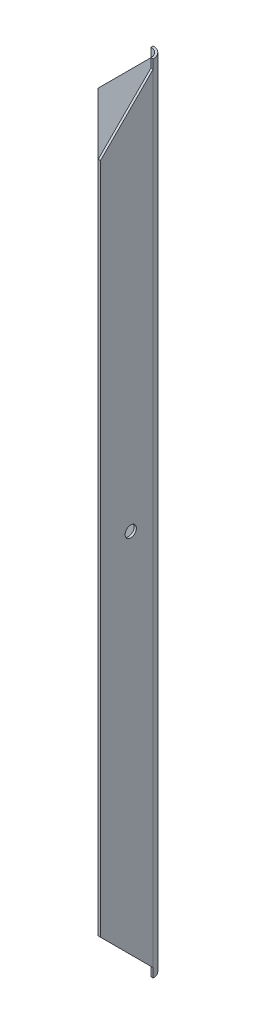
ISO-10303-21;
HEADER;
FILE_DESCRIPTION(('STEP AP214'),'2;1');
FILE_NAME('part.step','',(''),(''),'','','');
FILE_SCHEMA(('AUTOMOTIVE_DESIGN { 1 0 10303 214 1 1 1 1 }'));
ENDSEC;
DATA;
#1=APPLICATION_CONTEXT('core data for automotive mechanical design processes');
#2=APPLICATION_PROTOCOL_DEFINITION('international standard','automotive_design',2000,#1);
#3=PRODUCT_CONTEXT('',#1,'mechanical');
#4=PRODUCT('Part','Part','',(#3));
#5=PRODUCT_RELATED_PRODUCT_CATEGORY('part','',(#4));
#6=PRODUCT_DEFINITION_FORMATION('','',#4);
#7=PRODUCT_DEFINITION_CONTEXT('part definition',#1,'design');
#8=PRODUCT_DEFINITION('design','',#6,#7);
#9=PRODUCT_DEFINITION_SHAPE('','',#8);
#10=(LENGTH_UNIT() NAMED_UNIT(*) SI_UNIT(.MILLI.,.METRE.));
#11=(NAMED_UNIT(*) PLANE_ANGLE_UNIT() SI_UNIT($,.RADIAN.));
#12=(NAMED_UNIT(*) SI_UNIT($,.STERADIAN.) SOLID_ANGLE_UNIT());
#13=UNCERTAINTY_MEASURE_WITH_UNIT(LENGTH_MEASURE(1.E-05),#10,'distance_accuracy_value','');
#14=(GEOMETRIC_REPRESENTATION_CONTEXT(3) GLOBAL_UNCERTAINTY_ASSIGNED_CONTEXT((#13)) GLOBAL_UNIT_ASSIGNED_CONTEXT((#10,
#11,#12)) REPRESENTATION_CONTEXT('',''));
#15=CARTESIAN_POINT('',(0.,0.,0.));
#16=DIRECTION('',(0.,0.,1.));
#17=DIRECTION('',(1.,0.,0.));
#18=AXIS2_PLACEMENT_3D('',#15,#16,#17);
#19=CARTESIAN_POINT('',(0.,355.,-47.));
#20=DIRECTION('',(0.,0.,-1.));
#21=DIRECTION('',(-1.,0.,0.));
#22=AXIS2_PLACEMENT_3D('',#19,#20,#21);
#23=PLANE('',#22);
#24=DIRECTION('',(1.,0.,0.));
#25=VECTOR('',#24,1.);
#26=CARTESIAN_POINT('',(0.,-347.,-47.));
#27=LINE('',#26,#25);
#28=CARTESIAN_POINT('',(0.,-347.,-47.));
#29=VERTEX_POINT('',#28);
#30=CARTESIAN_POINT('',(1.99999999999999,-347.,-47.));
#31=VERTEX_POINT('',#30);
#32=EDGE_CURVE('E11',#29,#31,#27,.T.);
#33=ORIENTED_EDGE('',*,*,#32,.F.);
#34=DIRECTION('',(0.,-1.,0.));
#35=VECTOR('',#34,1.);
#36=CARTESIAN_POINT('',(0.,355.,-47.));
#37=LINE('',#36,#35);
#38=CARTESIAN_POINT('',(0.,-355.,-47.));
#39=VERTEX_POINT('',#38);
#40=EDGE_CURVE('E151',#29,#39,#37,.T.);
#41=ORIENTED_EDGE('',*,*,#40,.T.);
#42=DIRECTION('',(1.,0.,0.));
#43=VECTOR('',#42,1.);
#44=CARTESIAN_POINT('',(0.,-355.,-47.));
#45=LINE('',#44,#43);
#46=CARTESIAN_POINT('',(1.99999999999999,-355.,-47.));
#47=VERTEX_POINT('',#46);
#48=EDGE_CURVE('E205',#39,#47,#45,.T.);
#49=ORIENTED_EDGE('',*,*,#48,.T.);
#50=DIRECTION('',(0.,-1.,0.));
#51=VECTOR('',#50,1.);
#52=CARTESIAN_POINT('',(1.99999999999999,355.,-47.));
#53=LINE('',#52,#51);
#54=EDGE_CURVE('E168',#31,#47,#53,.T.);
#55=ORIENTED_EDGE('',*,*,#54,.F.);
#56=EDGE_LOOP('',(#33,#41,#49,#55));
#57=FACE_BOUND('',#56,.T.);
#58=ADVANCED_FACE('F41',(#57),#23,.F.);
#59=DIRECTION('',(-1.,0.,0.));
#60=VECTOR('',#59,1.);
#61=CARTESIAN_POINT('',(0.,347.,-47.));
#62=LINE('',#61,#60);
#63=CARTESIAN_POINT('',(2.,347.,-47.));
#64=VERTEX_POINT('',#63);
#65=CARTESIAN_POINT('',(0.,347.,-47.0000000000001));
#66=VERTEX_POINT('',#65);
#67=EDGE_CURVE('E49',#64,#66,#62,.T.);
#68=ORIENTED_EDGE('',*,*,#67,.F.);
#69=CARTESIAN_POINT('',(1.99999999999999,355.,-47.));
#70=VERTEX_POINT('',#69);
#71=EDGE_CURVE('E162',#70,#64,#53,.T.);
#72=ORIENTED_EDGE('',*,*,#71,.F.);
#73=DIRECTION('',(1.,0.,0.));
#74=VECTOR('',#73,1.);
#75=CARTESIAN_POINT('',(0.,355.,-47.));
#76=LINE('',#75,#74);
#77=CARTESIAN_POINT('',(0.,355.,-47.));
#78=VERTEX_POINT('',#77);
#79=EDGE_CURVE('E155',#78,#70,#76,.T.);
#80=ORIENTED_EDGE('',*,*,#79,.F.);
#81=EDGE_CURVE('E147',#78,#66,#37,.T.);
#82=ORIENTED_EDGE('',*,*,#81,.T.);
#83=EDGE_LOOP('',(#68,#72,#80,#82));
#84=FACE_BOUND('',#83,.T.);
#85=ADVANCED_FACE('F153',(#84),#23,.F.);
#86=CARTESIAN_POINT('',(-54.9999999999999,300.,-54.9999999999999));
#87=DIRECTION('',(-1.,0.,0.));
#88=DIRECTION('',(0.,-1.,0.));
#89=AXIS2_PLACEMENT_3D('',#86,#87,#88);
#90=PLANE('',#89);
#91=DIRECTION('',(0.,1.,0.));
#92=VECTOR('',#91,1.);
#93=CARTESIAN_POINT('',(-54.9999999999999,300.,-56.9999999999999));
#94=LINE('',#93,#92);
#95=CARTESIAN_POINT('',(-55.,-300.,-57.));
#96=VERTEX_POINT('',#95);
#97=CARTESIAN_POINT('',(-54.9999999999999,300.,-56.9999999999999));
#98=VERTEX_POINT('',#97);
#99=EDGE_CURVE('E80',#96,#98,#94,.T.);
#100=ORIENTED_EDGE('',*,*,#99,.F.);
#101=DIRECTION('',(0.,0.,-1.));
#102=VECTOR('',#101,1.);
#103=CARTESIAN_POINT('',(-55.,-300.,-55.));
#104=LINE('',#103,#102);
#105=CARTESIAN_POINT('',(-55.,-300.,-55.));
#106=VERTEX_POINT('',#105);
#107=EDGE_CURVE('E83',#106,#96,#104,.T.);
#108=ORIENTED_EDGE('',*,*,#107,.F.);
#109=DIRECTION('',(0.,1.,0.));
#110=VECTOR('',#109,1.);
#111=CARTESIAN_POINT('',(-54.9999999999999,300.,-54.9999999999999));
#112=LINE('',#111,#110);
#113=CARTESIAN_POINT('',(-54.9999999999999,300.,-54.9999999999999));
#114=VERTEX_POINT('',#113);
#115=EDGE_CURVE('E82',#106,#114,#112,.T.);
#116=ORIENTED_EDGE('',*,*,#115,.T.);
#117=DIRECTION('',(0.,0.,-1.));
#118=VECTOR('',#117,1.);
#119=CARTESIAN_POINT('',(-54.9999999999999,300.,-54.9999999999999));
#120=LINE('',#119,#118);
#121=EDGE_CURVE('E64',#114,#98,#120,.T.);
#122=ORIENTED_EDGE('',*,*,#121,.T.);
#123=EDGE_LOOP('',(#100,#108,#116,#122));
#124=FACE_BOUND('',#123,.T.);
#125=ADVANCED_FACE('F77',(#124),#90,.T.);
#126=CARTESIAN_POINT('',(0.,0.,-54.9999999999999));
#127=DIRECTION('',(0.,0.,1.));
#128=DIRECTION('',(0.,-1.,0.));
#129=AXIS2_PLACEMENT_3D('',#126,#127,#128);
#130=PLANE('',#129);
#131=CARTESIAN_POINT('',(-28.,0.,-54.9999999999999));
#132=DIRECTION('',(0.,0.,1.));
#133=DIRECTION('',(0.,-1.,0.));
#134=AXIS2_PLACEMENT_3D('',#131,#132,#133);
#135=CIRCLE('',#134,5.);
#136=CARTESIAN_POINT('',(-28.,-4.99999999999998,-54.9999999999999));
#137=VERTEX_POINT('',#136);
#138=EDGE_CURVE('E226',#137,#137,#135,.T.);
#139=ORIENTED_EDGE('',*,*,#138,.F.);
#140=EDGE_LOOP('',(#139));
#141=FACE_BOUND('',#140,.T.);
#142=DIRECTION('',(0.,-1.,0.));
#143=VECTOR('',#142,1.);
#144=CARTESIAN_POINT('',(-7.99999999999999,355.,-55.));
#145=LINE('',#144,#143);
#146=CARTESIAN_POINT('',(-7.99999999999999,347.,-55.));
#147=VERTEX_POINT('',#146);
#148=CARTESIAN_POINT('',(-7.99999999999999,-347.,-55.));
#149=VERTEX_POINT('',#148);
#150=EDGE_CURVE('E158',#147,#149,#145,.T.);
#151=ORIENTED_EDGE('',*,*,#150,.F.);
#152=DIRECTION('',(0.707106781186549,0.707106781186546,0.));
#153=VECTOR('',#152,1.);
#154=CARTESIAN_POINT('',(-54.9999999999999,300.,-54.9999999999999));
#155=LINE('',#154,#153);
#156=EDGE_CURVE('E105',#114,#147,#155,.T.);
#157=ORIENTED_EDGE('',*,*,#156,.F.);
#158=ORIENTED_EDGE('',*,*,#115,.F.);
#159=DIRECTION('',(-0.70710678118655,0.707106781186545,0.));
#160=VECTOR('',#159,1.);
#161=CARTESIAN_POINT('',(-55.,-300.,-55.));
#162=LINE('',#161,#160);
#163=EDGE_CURVE('E95',#149,#106,#162,.T.);
#164=ORIENTED_EDGE('',*,*,#163,.F.);
#165=EDGE_LOOP('',(#151,#157,#158,#164));
#166=FACE_BOUND('',#165,.T.);
#167=ADVANCED_FACE('F189',(#141,#166),#130,.T.);
#168=CARTESIAN_POINT('',(-54.9999999999999,300.,-54.9999999999999));
#169=DIRECTION('',(-0.707106781186546,0.707106781186549,0.));
#170=DIRECTION('',(-0.707106781186549,-0.707106781186546,0.));
#171=AXIS2_PLACEMENT_3D('',#168,#169,#170);
#172=PLANE('',#171);
#173=DIRECTION('',(0.,0.,1.));
#174=VECTOR('',#173,1.);
#175=CARTESIAN_POINT('',(-7.99999999999999,347.,-54.9999999999998));
#176=LINE('',#175,#174);
#177=CARTESIAN_POINT('',(-7.99999999999999,347.,-57.));
#178=VERTEX_POINT('',#177);
#179=EDGE_CURVE('E91',#178,#147,#176,.T.);
#180=ORIENTED_EDGE('',*,*,#179,.F.);
#181=DIRECTION('',(0.707106781186549,0.707106781186546,0.));
#182=VECTOR('',#181,1.);
#183=CARTESIAN_POINT('',(-54.9999999999999,300.,-56.9999999999999));
#184=LINE('',#183,#182);
#185=EDGE_CURVE('E87',#98,#178,#184,.T.);
#186=ORIENTED_EDGE('',*,*,#185,.F.);
#187=ORIENTED_EDGE('',*,*,#121,.F.);
#188=ORIENTED_EDGE('',*,*,#156,.T.);
#189=EDGE_LOOP('',(#180,#186,#187,#188));
#190=FACE_BOUND('',#189,.T.);
#191=ADVANCED_FACE('F88',(#190),#172,.T.);
#192=CARTESIAN_POINT('',(-55.,-300.,-55.));
#193=DIRECTION('',(-0.707106781186545,-0.70710678118655,0.));
#194=DIRECTION('',(0.70710678118655,-0.707106781186545,0.));
#195=AXIS2_PLACEMENT_3D('',#192,#193,#194);
#196=PLANE('',#195);
#197=DIRECTION('',(0.,0.,-1.));
#198=VECTOR('',#197,1.);
#199=CARTESIAN_POINT('',(-7.99999999999999,-347.,-55.));
#200=LINE('',#199,#198);
#201=CARTESIAN_POINT('',(-7.99999999999999,-347.,-57.));
#202=VERTEX_POINT('',#201);
#203=EDGE_CURVE('E178',#149,#202,#200,.T.);
#204=ORIENTED_EDGE('',*,*,#203,.F.);
#205=ORIENTED_EDGE('',*,*,#163,.T.);
#206=ORIENTED_EDGE('',*,*,#107,.T.);
#207=DIRECTION('',(-0.70710678118655,0.707106781186545,0.));
#208=VECTOR('',#207,1.);
#209=CARTESIAN_POINT('',(-55.,-300.,-57.));
#210=LINE('',#209,#208);
#211=EDGE_CURVE('E98',#202,#96,#210,.T.);
#212=ORIENTED_EDGE('',*,*,#211,.F.);
#213=EDGE_LOOP('',(#204,#205,#206,#212));
#214=FACE_BOUND('',#213,.T.);
#215=ADVANCED_FACE('F279',(#214),#196,.T.);
#216=CARTESIAN_POINT('',(2.,0.,-56.9999999999999));
#217=DIRECTION('',(0.,0.,-1.));
#218=DIRECTION('',(0.,1.,0.));
#219=AXIS2_PLACEMENT_3D('',#216,#217,#218);
#220=PLANE('',#219);
#221=CARTESIAN_POINT('',(-28.,0.,-56.9999999999999));
#222=DIRECTION('',(0.,0.,-1.));
#223=DIRECTION('',(0.,1.,0.));
#224=AXIS2_PLACEMENT_3D('',#221,#222,#223);
#225=CIRCLE('',#224,5.);
#226=CARTESIAN_POINT('',(-28.,5.00000000000002,-56.9999999999999));
#227=VERTEX_POINT('',#226);
#228=EDGE_CURVE('E230',#227,#227,#225,.T.);
#229=ORIENTED_EDGE('',*,*,#228,.F.);
#230=EDGE_LOOP('',(#229));
#231=FACE_BOUND('',#230,.T.);
#232=DIRECTION('',(0.,1.,0.));
#233=VECTOR('',#232,1.);
#234=CARTESIAN_POINT('',(-8.,-355.001,-57.));
#235=LINE('',#234,#233);
#236=EDGE_CURVE('E101',#202,#178,#235,.T.);
#237=ORIENTED_EDGE('',*,*,#236,.F.);
#238=ORIENTED_EDGE('',*,*,#211,.T.);
#239=ORIENTED_EDGE('',*,*,#99,.T.);
#240=ORIENTED_EDGE('',*,*,#185,.T.);
#241=EDGE_LOOP('',(#237,#238,#239,#240));
#242=FACE_BOUND('',#241,.T.);
#243=ADVANCED_FACE('F43',(#231,#242),#220,.T.);
#244=CARTESIAN_POINT('',(-8.,-355.001,-47.));
#245=DIRECTION('',(0.,1.,0.));
#246=DIRECTION('',(0.,0.,1.));
#247=AXIS2_PLACEMENT_3D('',#244,#245,#246);
#248=CYLINDRICAL_SURFACE('',#247,10.);
#249=DIRECTION('',(0.,1.,0.));
#250=VECTOR('',#249,1.);
#251=CARTESIAN_POINT('',(2.,-355.001,-47.));
#252=LINE('',#251,#250);
#253=EDGE_CURVE('E214',#31,#64,#252,.T.);
#254=ORIENTED_EDGE('',*,*,#253,.F.);
#255=ORIENTED_EDGE('',*,*,#54,.T.);
#256=CARTESIAN_POINT('',(-8.,-355.,-47.));
#257=DIRECTION('',(0.,-1.,0.));
#258=DIRECTION('',(0.,0.,-1.));
#259=AXIS2_PLACEMENT_3D('',#256,#257,#258);
#260=CIRCLE('',#259,9.99999999999999);
#261=CARTESIAN_POINT('',(-7.99999999999999,-355.,-57.));
#262=VERTEX_POINT('',#261);
#263=EDGE_CURVE('E207',#262,#47,#260,.T.);
#264=ORIENTED_EDGE('',*,*,#263,.F.);
#265=DIRECTION('',(0.,-1.,0.));
#266=VECTOR('',#265,1.);
#267=CARTESIAN_POINT('',(-7.99999999999999,355.,-57.));
#268=LINE('',#267,#266);
#269=EDGE_CURVE('E177',#202,#262,#268,.T.);
#270=ORIENTED_EDGE('',*,*,#269,.F.);
#271=ORIENTED_EDGE('',*,*,#236,.T.);
#272=CARTESIAN_POINT('',(-7.99999999999999,355.,-57.));
#273=VERTEX_POINT('',#272);
#274=EDGE_CURVE('E173',#273,#178,#268,.T.);
#275=ORIENTED_EDGE('',*,*,#274,.F.);
#276=CARTESIAN_POINT('',(-8.,355.,-47.));
#277=DIRECTION('',(0.,-1.,0.));
#278=DIRECTION('',(0.,0.,-1.));
#279=AXIS2_PLACEMENT_3D('',#276,#277,#278);
#280=CIRCLE('',#279,9.99999999999999);
#281=EDGE_CURVE('E198',#273,#70,#280,.T.);
#282=ORIENTED_EDGE('',*,*,#281,.T.);
#283=ORIENTED_EDGE('',*,*,#71,.T.);
#284=EDGE_LOOP('',(#254,#255,#264,#270,#271,#275,#282,#283));
#285=FACE_BOUND('',#284,.T.);
#286=ADVANCED_FACE('F271',(#285),#248,.T.);
#287=CARTESIAN_POINT('',(-7.99999999999999,355.,-55.));
#288=DIRECTION('',(-1.,0.,0.));
#289=DIRECTION('',(0.,0.,1.));
#290=AXIS2_PLACEMENT_3D('',#287,#288,#289);
#291=PLANE('',#290);
#292=ORIENTED_EDGE('',*,*,#274,.T.);
#293=ORIENTED_EDGE('',*,*,#179,.T.);
#294=CARTESIAN_POINT('',(-7.99999999999999,355.,-55.));
#295=VERTEX_POINT('',#294);
#296=EDGE_CURVE('E160',#295,#147,#145,.T.);
#297=ORIENTED_EDGE('',*,*,#296,.F.);
#298=DIRECTION('',(0.,0.,-1.));
#299=VECTOR('',#298,1.);
#300=CARTESIAN_POINT('',(-7.99999999999999,355.,-55.));
#301=LINE('',#300,#299);
#302=EDGE_CURVE('E200',#295,#273,#301,.T.);
#303=ORIENTED_EDGE('',*,*,#302,.T.);
#304=EDGE_LOOP('',(#292,#293,#297,#303));
#305=FACE_BOUND('',#304,.T.);
#306=ADVANCED_FACE('F269',(#305),#291,.T.);
#307=CARTESIAN_POINT('',(-7.99999999999999,-355.,-55.));
#308=VERTEX_POINT('',#307);
#309=EDGE_CURVE('E156',#149,#308,#145,.T.);
#310=ORIENTED_EDGE('',*,*,#309,.F.);
#311=ORIENTED_EDGE('',*,*,#203,.T.);
#312=ORIENTED_EDGE('',*,*,#269,.T.);
#313=DIRECTION('',(0.,0.,-1.));
#314=VECTOR('',#313,1.);
#315=CARTESIAN_POINT('',(-7.99999999999999,-355.,-55.));
#316=LINE('',#315,#314);
#317=EDGE_CURVE('E210',#308,#262,#316,.T.);
#318=ORIENTED_EDGE('',*,*,#317,.F.);
#319=EDGE_LOOP('',(#310,#311,#312,#318));
#320=FACE_BOUND('',#319,.T.);
#321=ADVANCED_FACE('F266',(#320),#291,.T.);
#322=CARTESIAN_POINT('',(-8.,355.,-47.));
#323=DIRECTION('',(0.,-1.,0.));
#324=DIRECTION('',(0.,0.,-1.));
#325=AXIS2_PLACEMENT_3D('',#322,#323,#324);
#326=CYLINDRICAL_SURFACE('',#325,8.);
#327=ORIENTED_EDGE('',*,*,#296,.T.);
#328=ORIENTED_EDGE('',*,*,#150,.T.);
#329=ORIENTED_EDGE('',*,*,#309,.T.);
#330=CARTESIAN_POINT('',(-8.,-355.,-47.));
#331=DIRECTION('',(0.,-1.,0.));
#332=DIRECTION('',(0.,0.,-1.));
#333=AXIS2_PLACEMENT_3D('',#330,#331,#332);
#334=CIRCLE('',#333,8.);
#335=EDGE_CURVE('E203',#308,#39,#334,.T.);
#336=ORIENTED_EDGE('',*,*,#335,.T.);
#337=ORIENTED_EDGE('',*,*,#40,.F.);
#338=EDGE_CURVE('E134',#66,#29,#37,.T.);
#339=ORIENTED_EDGE('',*,*,#338,.F.);
#340=ORIENTED_EDGE('',*,*,#81,.F.);
#341=CARTESIAN_POINT('',(-8.,355.,-47.));
#342=DIRECTION('',(0.,-1.,0.));
#343=DIRECTION('',(0.,0.,-1.));
#344=AXIS2_PLACEMENT_3D('',#341,#342,#343);
#345=CIRCLE('',#344,8.);
#346=EDGE_CURVE('E194',#295,#78,#345,.T.);
#347=ORIENTED_EDGE('',*,*,#346,.F.);
#348=EDGE_LOOP('',(#327,#328,#329,#336,#337,#339,#340,#347));
#349=FACE_BOUND('',#348,.T.);
#350=ADVANCED_FACE('F144',(#349),#326,.F.);
#351=CARTESIAN_POINT('',(-8.,355.,-47.));
#352=DIRECTION('',(0.,-1.,0.));
#353=DIRECTION('',(0.,0.,-1.));
#354=AXIS2_PLACEMENT_3D('',#351,#352,#353);
#355=PLANE('',#354);
#356=ORIENTED_EDGE('',*,*,#302,.F.);
#357=ORIENTED_EDGE('',*,*,#346,.T.);
#358=ORIENTED_EDGE('',*,*,#79,.T.);
#359=ORIENTED_EDGE('',*,*,#281,.F.);
#360=EDGE_LOOP('',(#356,#357,#358,#359));
#361=FACE_BOUND('',#360,.T.);
#362=ADVANCED_FACE('F329',(#361),#355,.F.);
#363=CARTESIAN_POINT('',(-8.,-355.,-47.));
#364=DIRECTION('',(0.,-1.,0.));
#365=DIRECTION('',(0.,0.,-1.));
#366=AXIS2_PLACEMENT_3D('',#363,#364,#365);
#367=PLANE('',#366);
#368=ORIENTED_EDGE('',*,*,#317,.T.);
#369=ORIENTED_EDGE('',*,*,#263,.T.);
#370=ORIENTED_EDGE('',*,*,#48,.F.);
#371=ORIENTED_EDGE('',*,*,#335,.F.);
#372=EDGE_LOOP('',(#368,#369,#370,#371));
#373=FACE_BOUND('',#372,.T.);
#374=ADVANCED_FACE('F326',(#373),#367,.T.);
#375=CARTESIAN_POINT('',(2.,-150.,150.));
#376=DIRECTION('',(0.,0.707106781186547,-0.707106781186548));
#377=DIRECTION('',(0.,0.707106781186548,0.707106781186547));
#378=AXIS2_PLACEMENT_3D('',#375,#376,#377);
#379=PLANE('',#378);
#380=DIRECTION('',(0.,-0.707106781186548,-0.707106781186547));
#381=VECTOR('',#380,1.);
#382=CARTESIAN_POINT('',(0.,-150.,150.));
#383=LINE('',#382,#381);
#384=CARTESIAN_POINT('',(0.,-300.,0.));
#385=VERTEX_POINT('',#384);
#386=EDGE_CURVE('E138',#385,#29,#383,.T.);
#387=ORIENTED_EDGE('',*,*,#386,.T.);
#388=ORIENTED_EDGE('',*,*,#32,.T.);
#389=DIRECTION('',(0.,-0.707106781186548,-0.707106781186547));
#390=VECTOR('',#389,1.);
#391=CARTESIAN_POINT('',(2.,-150.,150.));
#392=LINE('',#391,#390);
#393=CARTESIAN_POINT('',(2.,-300.,0.));
#394=VERTEX_POINT('',#393);
#395=EDGE_CURVE('E56',#394,#31,#392,.T.);
#396=ORIENTED_EDGE('',*,*,#395,.F.);
#397=DIRECTION('',(-1.,0.,0.));
#398=VECTOR('',#397,1.);
#399=CARTESIAN_POINT('',(2.,-300.,0.));
#400=LINE('',#399,#398);
#401=EDGE_CURVE('E221',#394,#385,#400,.T.);
#402=ORIENTED_EDGE('',*,*,#401,.T.);
#403=EDGE_LOOP('',(#387,#388,#396,#402));
#404=FACE_BOUND('',#403,.T.);
#405=ADVANCED_FACE('F323',(#404),#379,.F.);
#406=CARTESIAN_POINT('',(2.,149.999999999999,150.));
#407=DIRECTION('',(0.,-0.707106781186546,-0.707106781186549));
#408=DIRECTION('',(0.,0.707106781186549,-0.707106781186546));
#409=AXIS2_PLACEMENT_3D('',#406,#407,#408);
#410=PLANE('',#409);
#411=DIRECTION('',(0.,-0.707106781186549,0.707106781186546));
#412=VECTOR('',#411,1.);
#413=CARTESIAN_POINT('',(2.,149.999999999999,150.));
#414=LINE('',#413,#412);
#415=CARTESIAN_POINT('',(2.,300.,1.10218211923262E-13));
#416=VERTEX_POINT('',#415);
#417=EDGE_CURVE('E120',#64,#416,#414,.T.);
#418=ORIENTED_EDGE('',*,*,#417,.F.);
#419=ORIENTED_EDGE('',*,*,#67,.T.);
#420=DIRECTION('',(0.,-0.707106781186549,0.707106781186546));
#421=VECTOR('',#420,1.);
#422=CARTESIAN_POINT('',(0.,149.999999999999,150.));
#423=LINE('',#422,#421);
#424=CARTESIAN_POINT('',(0.,300.,1.10218211923262E-13));
#425=VERTEX_POINT('',#424);
#426=EDGE_CURVE('E116',#66,#425,#423,.T.);
#427=ORIENTED_EDGE('',*,*,#426,.T.);
#428=DIRECTION('',(-1.,0.,0.));
#429=VECTOR('',#428,1.);
#430=CARTESIAN_POINT('',(2.,300.,1.10218211923262E-13));
#431=LINE('',#430,#429);
#432=EDGE_CURVE('E213',#416,#425,#431,.T.);
#433=ORIENTED_EDGE('',*,*,#432,.F.);
#434=EDGE_LOOP('',(#418,#419,#427,#433));
#435=FACE_BOUND('',#434,.T.);
#436=ADVANCED_FACE('F113',(#435),#410,.F.);
#437=CARTESIAN_POINT('',(0.,0.,0.));
#438=DIRECTION('',(1.,0.,0.));
#439=DIRECTION('',(0.,0.,-1.));
#440=AXIS2_PLACEMENT_3D('',#437,#438,#439);
#441=PLANE('',#440);
#442=CARTESIAN_POINT('',(0.,0.,-27.));
#443=DIRECTION('',(1.,0.,0.));
#444=DIRECTION('',(0.,0.,-1.));
#445=AXIS2_PLACEMENT_3D('',#442,#443,#444);
#446=CIRCLE('',#445,5.);
#447=CARTESIAN_POINT('',(0.,0.,-32.));
#448=VERTEX_POINT('',#447);
#449=EDGE_CURVE('E233',#448,#448,#446,.T.);
#450=ORIENTED_EDGE('',*,*,#449,.T.);
#451=EDGE_LOOP('',(#450));
#452=FACE_BOUND('',#451,.T.);
#453=ORIENTED_EDGE('',*,*,#426,.F.);
#454=ORIENTED_EDGE('',*,*,#338,.T.);
#455=ORIENTED_EDGE('',*,*,#386,.F.);
#456=DIRECTION('',(0.,1.,0.));
#457=VECTOR('',#456,1.);
#458=CARTESIAN_POINT('',(0.,0.,0.));
#459=LINE('',#458,#457);
#460=EDGE_CURVE('E137',#385,#425,#459,.T.);
#461=ORIENTED_EDGE('',*,*,#460,.T.);
#462=EDGE_LOOP('',(#453,#454,#455,#461));
#463=FACE_BOUND('',#462,.T.);
#464=ADVANCED_FACE('F132',(#452,#463),#441,.F.);
#465=CARTESIAN_POINT('',(2.,0.,0.));
#466=DIRECTION('',(1.,0.,0.));
#467=DIRECTION('',(0.,0.,-1.));
#468=AXIS2_PLACEMENT_3D('',#465,#466,#467);
#469=PLANE('',#468);
#470=CARTESIAN_POINT('',(2.,0.,-27.));
#471=DIRECTION('',(1.,0.,0.));
#472=DIRECTION('',(0.,0.,-1.));
#473=AXIS2_PLACEMENT_3D('',#470,#471,#472);
#474=CIRCLE('',#473,5.);
#475=CARTESIAN_POINT('',(2.,0.,-32.));
#476=VERTEX_POINT('',#475);
#477=EDGE_CURVE('E236',#476,#476,#474,.T.);
#478=ORIENTED_EDGE('',*,*,#477,.F.);
#479=EDGE_LOOP('',(#478));
#480=FACE_BOUND('',#479,.T.);
#481=ORIENTED_EDGE('',*,*,#395,.T.);
#482=ORIENTED_EDGE('',*,*,#253,.T.);
#483=ORIENTED_EDGE('',*,*,#417,.T.);
#484=DIRECTION('',(0.,1.,0.));
#485=VECTOR('',#484,1.);
#486=CARTESIAN_POINT('',(2.,0.,0.));
#487=LINE('',#486,#485);
#488=EDGE_CURVE('E218',#394,#416,#487,.T.);
#489=ORIENTED_EDGE('',*,*,#488,.F.);
#490=EDGE_LOOP('',(#481,#482,#483,#489));
#491=FACE_BOUND('',#490,.T.);
#492=ADVANCED_FACE('F243',(#480,#491),#469,.T.);
#493=CARTESIAN_POINT('',(2.,0.,0.));
#494=DIRECTION('',(0.,0.,1.));
#495=DIRECTION('',(0.,-1.,0.));
#496=AXIS2_PLACEMENT_3D('',#493,#494,#495);
#497=PLANE('',#496);
#498=ORIENTED_EDGE('',*,*,#460,.F.);
#499=ORIENTED_EDGE('',*,*,#401,.F.);
#500=ORIENTED_EDGE('',*,*,#488,.T.);
#501=ORIENTED_EDGE('',*,*,#432,.T.);
#502=EDGE_LOOP('',(#498,#499,#500,#501));
#503=FACE_BOUND('',#502,.T.);
#504=ADVANCED_FACE('F245',(#503),#497,.T.);
#505=CARTESIAN_POINT('',(-28.,0.,298.));
#506=DIRECTION('',(0.,0.,-1.));
#507=DIRECTION('',(0.,1.,0.));
#508=AXIS2_PLACEMENT_3D('',#505,#506,#507);
#509=CYLINDRICAL_SURFACE('',#508,5.);
#510=ORIENTED_EDGE('',*,*,#138,.T.);
#511=EDGE_LOOP('',(#510));
#512=FACE_BOUND('',#511,.T.);
#513=ORIENTED_EDGE('',*,*,#228,.T.);
#514=EDGE_LOOP('',(#513));
#515=FACE_BOUND('',#514,.T.);
#516=ADVANCED_FACE('F252',(#512,#515),#509,.F.);
#517=CARTESIAN_POINT('',(-353.,0.,-27.));
#518=DIRECTION('',(1.,0.,0.));
#519=DIRECTION('',(0.,0.,-1.));
#520=AXIS2_PLACEMENT_3D('',#517,#518,#519);
#521=CYLINDRICAL_SURFACE('',#520,5.);
#522=ORIENTED_EDGE('',*,*,#477,.T.);
#523=EDGE_LOOP('',(#522));
#524=FACE_BOUND('',#523,.T.);
#525=ORIENTED_EDGE('',*,*,#449,.F.);
#526=EDGE_LOOP('',(#525));
#527=FACE_BOUND('',#526,.T.);
#528=ADVANCED_FACE('F240',(#524,#527),#521,.F.);
#529=CLOSED_SHELL('',(#58,#85,#125,#167,#191,#215,#243,#286,#306,#321,#350,#362,#374,#405,#436,
#464,#492,#504,#516,#528));
#530=MANIFOLD_SOLID_BREP('B2',#529);
#531=ADVANCED_BREP_SHAPE_REPRESENTATION('',(#18,#530),#14);
#532=SHAPE_DEFINITION_REPRESENTATION(#9,#531);
ENDSEC;
END-ISO-10303-21;
